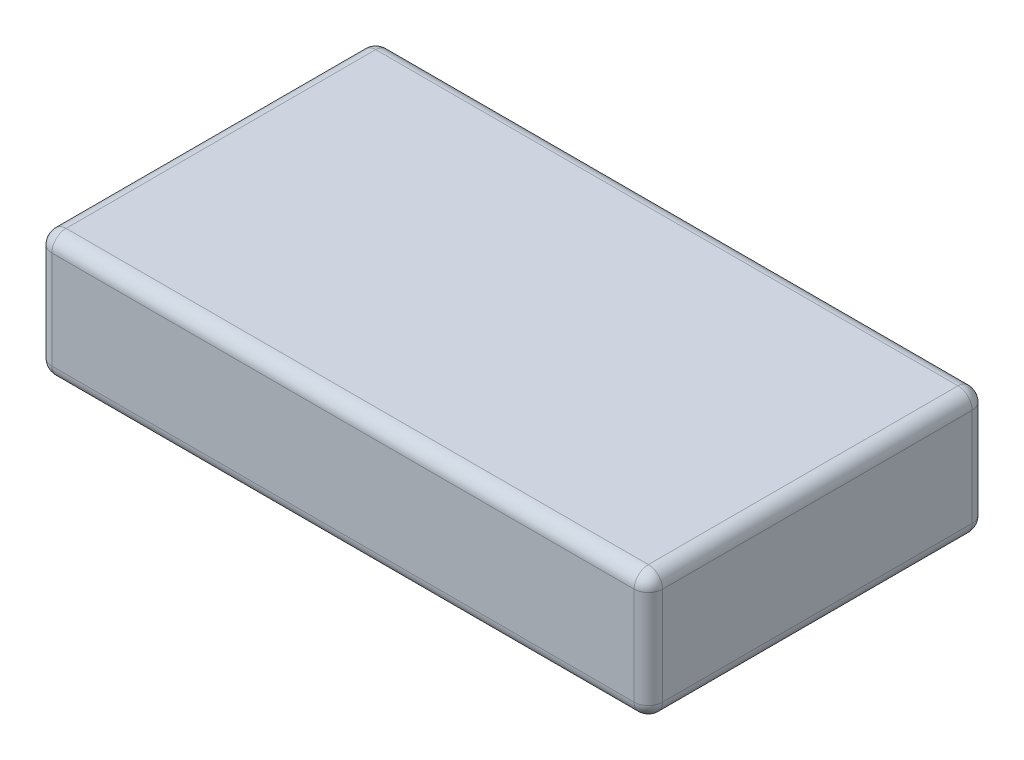
ISO-10303-21;
HEADER;
FILE_DESCRIPTION(('STEP AP214'),'2;1');
FILE_NAME('part.step','',(''),(''),'','','');
FILE_SCHEMA(('AUTOMOTIVE_DESIGN { 1 0 10303 214 1 1 1 1 }'));
ENDSEC;
DATA;
#1=APPLICATION_CONTEXT('core data for automotive mechanical design processes');
#2=APPLICATION_PROTOCOL_DEFINITION('international standard','automotive_design',2000,#1);
#3=PRODUCT_CONTEXT('',#1,'mechanical');
#4=PRODUCT('Part','Part','',(#3));
#5=PRODUCT_RELATED_PRODUCT_CATEGORY('part','',(#4));
#6=PRODUCT_DEFINITION_FORMATION('','',#4);
#7=PRODUCT_DEFINITION_CONTEXT('part definition',#1,'design');
#8=PRODUCT_DEFINITION('design','',#6,#7);
#9=PRODUCT_DEFINITION_SHAPE('','',#8);
#10=(LENGTH_UNIT() NAMED_UNIT(*) SI_UNIT(.MILLI.,.METRE.));
#11=(NAMED_UNIT(*) PLANE_ANGLE_UNIT() SI_UNIT($,.RADIAN.));
#12=(NAMED_UNIT(*) SI_UNIT($,.STERADIAN.) SOLID_ANGLE_UNIT());
#13=UNCERTAINTY_MEASURE_WITH_UNIT(LENGTH_MEASURE(1.E-05),#10,'distance_accuracy_value','');
#14=(GEOMETRIC_REPRESENTATION_CONTEXT(3) GLOBAL_UNCERTAINTY_ASSIGNED_CONTEXT((#13)) GLOBAL_UNIT_ASSIGNED_CONTEXT((#10,
#11,#12)) REPRESENTATION_CONTEXT('',''));
#15=CARTESIAN_POINT('',(0.,0.,0.));
#16=DIRECTION('',(0.,0.,1.));
#17=DIRECTION('',(1.,0.,0.));
#18=AXIS2_PLACEMENT_3D('',#15,#16,#17);
#19=CARTESIAN_POINT('',(-20.5,8.89,10.9));
#20=DIRECTION('',(0.,-1.,0.));
#21=DIRECTION('',(0.,0.,-1.));
#22=AXIS2_PLACEMENT_3D('',#19,#20,#21);
#23=CYLINDRICAL_SURFACE('',#22,1.);
#24=DIRECTION('',(0.,-1.,0.));
#25=VECTOR('',#24,1.);
#26=CARTESIAN_POINT('',(-21.5,8.89,10.9));
#27=LINE('',#26,#25);
#28=CARTESIAN_POINT('',(-21.5,7.89,10.9));
#29=VERTEX_POINT('',#28);
#30=CARTESIAN_POINT('',(-21.5,1.,10.9));
#31=VERTEX_POINT('',#30);
#32=EDGE_CURVE('E225',#29,#31,#27,.T.);
#33=ORIENTED_EDGE('',*,*,#32,.T.);
#34=CARTESIAN_POINT('',(-20.5,1.,10.9));
#35=DIRECTION('',(0.,-1.,0.));
#36=DIRECTION('',(0.,0.,-1.));
#37=AXIS2_PLACEMENT_3D('',#34,#35,#36);
#38=CIRCLE('',#37,1.);
#39=CARTESIAN_POINT('',(-20.5,1.,11.9));
#40=VERTEX_POINT('',#39);
#41=EDGE_CURVE('E197',#31,#40,#38,.F.);
#42=ORIENTED_EDGE('',*,*,#41,.T.);
#43=DIRECTION('',(0.,-1.,0.));
#44=VECTOR('',#43,1.);
#45=CARTESIAN_POINT('',(-20.5,8.89,11.9));
#46=LINE('',#45,#44);
#47=CARTESIAN_POINT('',(-20.5,7.89,11.9));
#48=VERTEX_POINT('',#47);
#49=EDGE_CURVE('E145',#48,#40,#46,.T.);
#50=ORIENTED_EDGE('',*,*,#49,.F.);
#51=CARTESIAN_POINT('',(-20.5,7.89,10.9));
#52=DIRECTION('',(0.,-1.,0.));
#53=DIRECTION('',(0.,0.,-1.));
#54=AXIS2_PLACEMENT_3D('',#51,#52,#53);
#55=CIRCLE('',#54,1.);
#56=EDGE_CURVE('E195',#48,#29,#55,.T.);
#57=ORIENTED_EDGE('',*,*,#56,.T.);
#58=EDGE_LOOP('',(#33,#42,#50,#57));
#59=FACE_BOUND('',#58,.T.);
#60=ADVANCED_FACE('F33',(#59),#23,.T.);
#61=CARTESIAN_POINT('',(-20.5,8.89,11.9));
#62=DIRECTION('',(0.,0.,-1.));
#63=DIRECTION('',(-1.,0.,0.));
#64=AXIS2_PLACEMENT_3D('',#61,#62,#63);
#65=PLANE('',#64);
#66=ORIENTED_EDGE('',*,*,#49,.T.);
#67=DIRECTION('',(1.,0.,0.));
#68=VECTOR('',#67,1.);
#69=CARTESIAN_POINT('',(20.5,0.999999999999999,11.9));
#70=LINE('',#69,#68);
#71=CARTESIAN_POINT('',(20.5,1.,11.9));
#72=VERTEX_POINT('',#71);
#73=EDGE_CURVE('E144',#40,#72,#70,.T.);
#74=ORIENTED_EDGE('',*,*,#73,.T.);
#75=DIRECTION('',(0.,-1.,0.));
#76=VECTOR('',#75,1.);
#77=CARTESIAN_POINT('',(20.5,8.89,11.9));
#78=LINE('',#77,#76);
#79=CARTESIAN_POINT('',(20.5,7.89,11.9));
#80=VERTEX_POINT('',#79);
#81=EDGE_CURVE('E126',#80,#72,#78,.T.);
#82=ORIENTED_EDGE('',*,*,#81,.F.);
#83=DIRECTION('',(1.,0.,0.));
#84=VECTOR('',#83,1.);
#85=CARTESIAN_POINT('',(-20.5,7.89,11.9));
#86=LINE('',#85,#84);
#87=EDGE_CURVE('E141',#80,#48,#86,.F.);
#88=ORIENTED_EDGE('',*,*,#87,.T.);
#89=EDGE_LOOP('',(#66,#74,#82,#88));
#90=FACE_BOUND('',#89,.T.);
#91=ADVANCED_FACE('F139',(#90),#65,.F.);
#92=CARTESIAN_POINT('',(20.5,8.89,10.9));
#93=DIRECTION('',(0.,-1.,0.));
#94=DIRECTION('',(0.,0.,-1.));
#95=AXIS2_PLACEMENT_3D('',#92,#93,#94);
#96=CYLINDRICAL_SURFACE('',#95,1.);
#97=ORIENTED_EDGE('',*,*,#81,.T.);
#98=CARTESIAN_POINT('',(20.5,1.,10.9));
#99=DIRECTION('',(0.,-1.,0.));
#100=DIRECTION('',(0.,0.,-1.));
#101=AXIS2_PLACEMENT_3D('',#98,#99,#100);
#102=CIRCLE('',#101,1.);
#103=CARTESIAN_POINT('',(21.5,1.,10.9));
#104=VERTEX_POINT('',#103);
#105=EDGE_CURVE('E133',#72,#104,#102,.F.);
#106=ORIENTED_EDGE('',*,*,#105,.T.);
#107=DIRECTION('',(0.,-1.,0.));
#108=VECTOR('',#107,1.);
#109=CARTESIAN_POINT('',(21.5,8.89,10.9));
#110=LINE('',#109,#108);
#111=CARTESIAN_POINT('',(21.5,7.89,10.9));
#112=VERTEX_POINT('',#111);
#113=EDGE_CURVE('E128',#112,#104,#110,.T.);
#114=ORIENTED_EDGE('',*,*,#113,.F.);
#115=CARTESIAN_POINT('',(20.5,7.89,10.9));
#116=DIRECTION('',(0.,-1.,0.));
#117=DIRECTION('',(0.,0.,-1.));
#118=AXIS2_PLACEMENT_3D('',#115,#116,#117);
#119=CIRCLE('',#118,1.);
#120=EDGE_CURVE('E123',#112,#80,#119,.T.);
#121=ORIENTED_EDGE('',*,*,#120,.T.);
#122=EDGE_LOOP('',(#97,#106,#114,#121));
#123=FACE_BOUND('',#122,.T.);
#124=ADVANCED_FACE('F125',(#123),#96,.T.);
#125=CARTESIAN_POINT('',(21.5,8.89,10.9));
#126=DIRECTION('',(-1.,0.,0.));
#127=DIRECTION('',(0.,0.,1.));
#128=AXIS2_PLACEMENT_3D('',#125,#126,#127);
#129=PLANE('',#128);
#130=ORIENTED_EDGE('',*,*,#113,.T.);
#131=DIRECTION('',(0.,0.,-1.));
#132=VECTOR('',#131,1.);
#133=CARTESIAN_POINT('',(21.5,0.999999999999999,-10.9));
#134=LINE('',#133,#132);
#135=CARTESIAN_POINT('',(21.5,1.,-10.9));
#136=VERTEX_POINT('',#135);
#137=EDGE_CURVE('E176',#104,#136,#134,.T.);
#138=ORIENTED_EDGE('',*,*,#137,.T.);
#139=DIRECTION('',(0.,-1.,0.));
#140=VECTOR('',#139,1.);
#141=CARTESIAN_POINT('',(21.5,8.89,-10.9));
#142=LINE('',#141,#140);
#143=CARTESIAN_POINT('',(21.5,7.89,-10.9));
#144=VERTEX_POINT('',#143);
#145=EDGE_CURVE('E246',#144,#136,#142,.T.);
#146=ORIENTED_EDGE('',*,*,#145,.F.);
#147=DIRECTION('',(0.,0.,-1.));
#148=VECTOR('',#147,1.);
#149=CARTESIAN_POINT('',(21.5,7.89,10.9));
#150=LINE('',#149,#148);
#151=EDGE_CURVE('E174',#144,#112,#150,.F.);
#152=ORIENTED_EDGE('',*,*,#151,.T.);
#153=EDGE_LOOP('',(#130,#138,#146,#152));
#154=FACE_BOUND('',#153,.T.);
#155=ADVANCED_FACE('F243',(#154),#129,.F.);
#156=CARTESIAN_POINT('',(20.5,8.89,-10.9));
#157=DIRECTION('',(0.,-1.,0.));
#158=DIRECTION('',(0.,0.,-1.));
#159=AXIS2_PLACEMENT_3D('',#156,#157,#158);
#160=CYLINDRICAL_SURFACE('',#159,1.);
#161=ORIENTED_EDGE('',*,*,#145,.T.);
#162=CARTESIAN_POINT('',(20.5,1.,-10.9));
#163=DIRECTION('',(0.,-1.,0.));
#164=DIRECTION('',(0.,0.,-1.));
#165=AXIS2_PLACEMENT_3D('',#162,#163,#164);
#166=CIRCLE('',#165,1.);
#167=CARTESIAN_POINT('',(20.5,1.,-11.9));
#168=VERTEX_POINT('',#167);
#169=EDGE_CURVE('E180',#136,#168,#166,.F.);
#170=ORIENTED_EDGE('',*,*,#169,.T.);
#171=DIRECTION('',(0.,-1.,0.));
#172=VECTOR('',#171,1.);
#173=CARTESIAN_POINT('',(20.5,8.89,-11.9));
#174=LINE('',#173,#172);
#175=CARTESIAN_POINT('',(20.5,7.89,-11.9));
#176=VERTEX_POINT('',#175);
#177=EDGE_CURVE('E249',#176,#168,#174,.T.);
#178=ORIENTED_EDGE('',*,*,#177,.F.);
#179=CARTESIAN_POINT('',(20.5,7.89,-10.9));
#180=DIRECTION('',(0.,-1.,0.));
#181=DIRECTION('',(0.,0.,-1.));
#182=AXIS2_PLACEMENT_3D('',#179,#180,#181);
#183=CIRCLE('',#182,1.);
#184=EDGE_CURVE('E178',#176,#144,#183,.T.);
#185=ORIENTED_EDGE('',*,*,#184,.T.);
#186=EDGE_LOOP('',(#161,#170,#178,#185));
#187=FACE_BOUND('',#186,.T.);
#188=ADVANCED_FACE('F291',(#187),#160,.T.);
#189=CARTESIAN_POINT('',(-20.5,8.89,-11.9));
#190=DIRECTION('',(0.,0.,1.));
#191=DIRECTION('',(1.,0.,0.));
#192=AXIS2_PLACEMENT_3D('',#189,#190,#191);
#193=PLANE('',#192);
#194=ORIENTED_EDGE('',*,*,#177,.T.);
#195=DIRECTION('',(-1.,0.,0.));
#196=VECTOR('',#195,1.);
#197=CARTESIAN_POINT('',(-20.5,0.999999999999999,-11.9));
#198=LINE('',#197,#196);
#199=CARTESIAN_POINT('',(-20.5,1.,-11.9));
#200=VERTEX_POINT('',#199);
#201=EDGE_CURVE('E184',#168,#200,#198,.T.);
#202=ORIENTED_EDGE('',*,*,#201,.T.);
#203=DIRECTION('',(0.,-1.,0.));
#204=VECTOR('',#203,1.);
#205=CARTESIAN_POINT('',(-20.5,8.89,-11.9));
#206=LINE('',#205,#204);
#207=CARTESIAN_POINT('',(-20.5,7.89,-11.9));
#208=VERTEX_POINT('',#207);
#209=EDGE_CURVE('E253',#208,#200,#206,.T.);
#210=ORIENTED_EDGE('',*,*,#209,.F.);
#211=DIRECTION('',(-1.,0.,0.));
#212=VECTOR('',#211,1.);
#213=CARTESIAN_POINT('',(-20.5,7.89,-11.9));
#214=LINE('',#213,#212);
#215=EDGE_CURVE('E182',#208,#176,#214,.F.);
#216=ORIENTED_EDGE('',*,*,#215,.T.);
#217=EDGE_LOOP('',(#194,#202,#210,#216));
#218=FACE_BOUND('',#217,.T.);
#219=ADVANCED_FACE('F294',(#218),#193,.F.);
#220=CARTESIAN_POINT('',(-20.5,8.89,-10.9));
#221=DIRECTION('',(0.,-1.,0.));
#222=DIRECTION('',(0.,0.,-1.));
#223=AXIS2_PLACEMENT_3D('',#220,#221,#222);
#224=CYLINDRICAL_SURFACE('',#223,1.);
#225=ORIENTED_EDGE('',*,*,#209,.T.);
#226=CARTESIAN_POINT('',(-20.5,1.,-10.9));
#227=DIRECTION('',(0.,-1.,0.));
#228=DIRECTION('',(0.,0.,-1.));
#229=AXIS2_PLACEMENT_3D('',#226,#227,#228);
#230=CIRCLE('',#229,1.);
#231=CARTESIAN_POINT('',(-21.5,1.,-10.9));
#232=VERTEX_POINT('',#231);
#233=EDGE_CURVE('E188',#200,#232,#230,.F.);
#234=ORIENTED_EDGE('',*,*,#233,.T.);
#235=DIRECTION('',(0.,-1.,0.));
#236=VECTOR('',#235,1.);
#237=CARTESIAN_POINT('',(-21.5,8.89,-10.9));
#238=LINE('',#237,#236);
#239=CARTESIAN_POINT('',(-21.5,7.89,-10.9));
#240=VERTEX_POINT('',#239);
#241=EDGE_CURVE('E258',#240,#232,#238,.T.);
#242=ORIENTED_EDGE('',*,*,#241,.F.);
#243=CARTESIAN_POINT('',(-20.5,7.89,-10.9));
#244=DIRECTION('',(0.,-1.,0.));
#245=DIRECTION('',(0.,0.,-1.));
#246=AXIS2_PLACEMENT_3D('',#243,#244,#245);
#247=CIRCLE('',#246,1.);
#248=EDGE_CURVE('E186',#240,#208,#247,.T.);
#249=ORIENTED_EDGE('',*,*,#248,.T.);
#250=EDGE_LOOP('',(#225,#234,#242,#249));
#251=FACE_BOUND('',#250,.T.);
#252=ADVANCED_FACE('F307',(#251),#224,.T.);
#253=CARTESIAN_POINT('',(-21.5,8.89,10.9));
#254=DIRECTION('',(1.,0.,0.));
#255=DIRECTION('',(0.,0.,-1.));
#256=AXIS2_PLACEMENT_3D('',#253,#254,#255);
#257=PLANE('',#256);
#258=ORIENTED_EDGE('',*,*,#241,.T.);
#259=DIRECTION('',(0.,0.,1.));
#260=VECTOR('',#259,1.);
#261=CARTESIAN_POINT('',(-21.5,0.999999999999999,10.9));
#262=LINE('',#261,#260);
#263=EDGE_CURVE('E193',#232,#31,#262,.T.);
#264=ORIENTED_EDGE('',*,*,#263,.T.);
#265=ORIENTED_EDGE('',*,*,#32,.F.);
#266=DIRECTION('',(0.,0.,1.));
#267=VECTOR('',#266,1.);
#268=CARTESIAN_POINT('',(-21.5,7.89,10.9));
#269=LINE('',#268,#267);
#270=EDGE_CURVE('E190',#29,#240,#269,.F.);
#271=ORIENTED_EDGE('',*,*,#270,.T.);
#272=EDGE_LOOP('',(#258,#264,#265,#271));
#273=FACE_BOUND('',#272,.T.);
#274=ADVANCED_FACE('F308',(#273),#257,.F.);
#275=CARTESIAN_POINT('',(-20.5,8.89,10.9));
#276=DIRECTION('',(0.,-1.,0.));
#277=DIRECTION('',(0.,0.,-1.));
#278=AXIS2_PLACEMENT_3D('',#275,#276,#277);
#279=PLANE('',#278);
#280=DIRECTION('',(-1.,0.,0.));
#281=VECTOR('',#280,1.);
#282=CARTESIAN_POINT('',(-20.5,8.89,-10.9));
#283=LINE('',#282,#281);
#284=CARTESIAN_POINT('',(20.5,8.89,-10.9));
#285=VERTEX_POINT('',#284);
#286=CARTESIAN_POINT('',(-20.5,8.89,-10.9));
#287=VERTEX_POINT('',#286);
#288=EDGE_CURVE('E42',#285,#287,#283,.T.);
#289=ORIENTED_EDGE('',*,*,#288,.T.);
#290=DIRECTION('',(0.,0.,1.));
#291=VECTOR('',#290,1.);
#292=CARTESIAN_POINT('',(-20.5,8.89,10.9));
#293=LINE('',#292,#291);
#294=CARTESIAN_POINT('',(-20.5,8.89,10.9));
#295=VERTEX_POINT('',#294);
#296=EDGE_CURVE('E11',#287,#295,#293,.T.);
#297=ORIENTED_EDGE('',*,*,#296,.T.);
#298=DIRECTION('',(1.,0.,0.));
#299=VECTOR('',#298,1.);
#300=CARTESIAN_POINT('',(-20.5,8.89,10.9));
#301=LINE('',#300,#299);
#302=CARTESIAN_POINT('',(20.5,8.89,10.9));
#303=VERTEX_POINT('',#302);
#304=EDGE_CURVE('E199',#295,#303,#301,.T.);
#305=ORIENTED_EDGE('',*,*,#304,.T.);
#306=DIRECTION('',(0.,0.,-1.));
#307=VECTOR('',#306,1.);
#308=CARTESIAN_POINT('',(20.5,8.89,10.9));
#309=LINE('',#308,#307);
#310=EDGE_CURVE('E53',#303,#285,#309,.T.);
#311=ORIENTED_EDGE('',*,*,#310,.T.);
#312=EDGE_LOOP('',(#289,#297,#305,#311));
#313=FACE_BOUND('',#312,.T.);
#314=ADVANCED_FACE('F317',(#313),#279,.F.);
#315=CARTESIAN_POINT('',(-20.5,0.,10.9));
#316=DIRECTION('',(0.,-1.,0.));
#317=DIRECTION('',(0.,0.,-1.));
#318=AXIS2_PLACEMENT_3D('',#315,#316,#317);
#319=PLANE('',#318);
#320=DIRECTION('',(0.,0.,-1.));
#321=VECTOR('',#320,1.);
#322=CARTESIAN_POINT('',(20.5,0.,10.9));
#323=LINE('',#322,#321);
#324=CARTESIAN_POINT('',(20.5,0.,-10.9));
#325=VERTEX_POINT('',#324);
#326=CARTESIAN_POINT('',(20.5,0.,10.9));
#327=VERTEX_POINT('',#326);
#328=EDGE_CURVE('E169',#325,#327,#323,.F.);
#329=ORIENTED_EDGE('',*,*,#328,.T.);
#330=DIRECTION('',(1.,0.,0.));
#331=VECTOR('',#330,1.);
#332=CARTESIAN_POINT('',(-20.5,0.,10.9));
#333=LINE('',#332,#331);
#334=CARTESIAN_POINT('',(-20.5,0.,10.9));
#335=VERTEX_POINT('',#334);
#336=EDGE_CURVE('E134',#327,#335,#333,.F.);
#337=ORIENTED_EDGE('',*,*,#336,.T.);
#338=DIRECTION('',(0.,0.,1.));
#339=VECTOR('',#338,1.);
#340=CARTESIAN_POINT('',(-20.5,0.,-10.9));
#341=LINE('',#340,#339);
#342=CARTESIAN_POINT('',(-20.5,0.,-10.9));
#343=VERTEX_POINT('',#342);
#344=EDGE_CURVE('E162',#335,#343,#341,.F.);
#345=ORIENTED_EDGE('',*,*,#344,.T.);
#346=DIRECTION('',(-1.,0.,0.));
#347=VECTOR('',#346,1.);
#348=CARTESIAN_POINT('',(20.5,0.,-10.9));
#349=LINE('',#348,#347);
#350=EDGE_CURVE('E167',#343,#325,#349,.F.);
#351=ORIENTED_EDGE('',*,*,#350,.T.);
#352=EDGE_LOOP('',(#329,#337,#345,#351));
#353=FACE_BOUND('',#352,.T.);
#354=ADVANCED_FACE('F319',(#353),#319,.T.);
#355=CARTESIAN_POINT('',(-20.5,0.999999999999999,-10.9));
#356=DIRECTION('',(1.,0.,0.));
#357=DIRECTION('',(0.,0.,-1.));
#358=AXIS2_PLACEMENT_3D('',#355,#356,#357);
#359=CYLINDRICAL_SURFACE('',#358,1.);
#360=CARTESIAN_POINT('',(-20.5,0.999999999999999,-10.9));
#361=DIRECTION('',(-1.,0.,0.));
#362=DIRECTION('',(0.,0.,1.));
#363=AXIS2_PLACEMENT_3D('',#360,#361,#362);
#364=CIRCLE('',#363,1.);
#365=EDGE_CURVE('E222',#200,#343,#364,.T.);
#366=ORIENTED_EDGE('',*,*,#365,.F.);
#367=ORIENTED_EDGE('',*,*,#201,.F.);
#368=CARTESIAN_POINT('',(20.5,1.,-10.9));
#369=DIRECTION('',(1.,0.,0.));
#370=DIRECTION('',(0.,0.,-1.));
#371=AXIS2_PLACEMENT_3D('',#368,#369,#370);
#372=CIRCLE('',#371,1.);
#373=EDGE_CURVE('E219',#325,#168,#372,.T.);
#374=ORIENTED_EDGE('',*,*,#373,.F.);
#375=ORIENTED_EDGE('',*,*,#350,.F.);
#376=EDGE_LOOP('',(#366,#367,#374,#375));
#377=FACE_BOUND('',#376,.T.);
#378=ADVANCED_FACE('F299',(#377),#359,.T.);
#379=CARTESIAN_POINT('',(-20.5,0.999999999999999,-10.9));
#380=DIRECTION('',(0.,-1.,0.));
#381=DIRECTION('',(0.,0.,-1.));
#382=AXIS2_PLACEMENT_3D('',#379,#380,#381);
#383=SPHERICAL_SURFACE('',#382,1.);
#384=ORIENTED_EDGE('',*,*,#233,.F.);
#385=ORIENTED_EDGE('',*,*,#365,.T.);
#386=CARTESIAN_POINT('',(-20.5,1.,-10.9));
#387=DIRECTION('',(0.,0.,1.));
#388=DIRECTION('',(1.,0.,0.));
#389=AXIS2_PLACEMENT_3D('',#386,#387,#388);
#390=CIRCLE('',#389,1.);
#391=EDGE_CURVE('E216',#232,#343,#390,.T.);
#392=ORIENTED_EDGE('',*,*,#391,.F.);
#393=EDGE_LOOP('',(#384,#385,#392));
#394=FACE_BOUND('',#393,.T.);
#395=ADVANCED_FACE('F304',(#394),#383,.T.);
#396=CARTESIAN_POINT('',(20.5,0.999999999999999,-10.9));
#397=DIRECTION('',(0.,-1.,0.));
#398=DIRECTION('',(0.,0.,-1.));
#399=AXIS2_PLACEMENT_3D('',#396,#397,#398);
#400=SPHERICAL_SURFACE('',#399,1.);
#401=ORIENTED_EDGE('',*,*,#373,.T.);
#402=ORIENTED_EDGE('',*,*,#169,.F.);
#403=CARTESIAN_POINT('',(20.5,1.,-10.9));
#404=DIRECTION('',(0.,0.,1.));
#405=DIRECTION('',(1.,0.,0.));
#406=AXIS2_PLACEMENT_3D('',#403,#404,#405);
#407=CIRCLE('',#406,1.);
#408=EDGE_CURVE('E213',#325,#136,#407,.T.);
#409=ORIENTED_EDGE('',*,*,#408,.F.);
#410=EDGE_LOOP('',(#401,#402,#409));
#411=FACE_BOUND('',#410,.T.);
#412=ADVANCED_FACE('F288',(#411),#400,.T.);
#413=CARTESIAN_POINT('',(-20.5,0.999999999999999,10.9));
#414=DIRECTION('',(0.,0.,-1.));
#415=DIRECTION('',(-1.,0.,0.));
#416=AXIS2_PLACEMENT_3D('',#413,#414,#415);
#417=CYLINDRICAL_SURFACE('',#416,1.);
#418=ORIENTED_EDGE('',*,*,#391,.T.);
#419=ORIENTED_EDGE('',*,*,#344,.F.);
#420=CARTESIAN_POINT('',(-20.5,0.999999999999999,10.9));
#421=DIRECTION('',(0.,0.,1.));
#422=DIRECTION('',(1.,0.,0.));
#423=AXIS2_PLACEMENT_3D('',#420,#421,#422);
#424=CIRCLE('',#423,1.);
#425=EDGE_CURVE('E210',#31,#335,#424,.T.);
#426=ORIENTED_EDGE('',*,*,#425,.F.);
#427=ORIENTED_EDGE('',*,*,#263,.F.);
#428=EDGE_LOOP('',(#418,#419,#426,#427));
#429=FACE_BOUND('',#428,.T.);
#430=ADVANCED_FACE('F271',(#429),#417,.T.);
#431=CARTESIAN_POINT('',(20.5,0.999999999999999,10.9));
#432=DIRECTION('',(0.,0.,1.));
#433=DIRECTION('',(1.,0.,0.));
#434=AXIS2_PLACEMENT_3D('',#431,#432,#433);
#435=CYLINDRICAL_SURFACE('',#434,1.);
#436=ORIENTED_EDGE('',*,*,#408,.T.);
#437=ORIENTED_EDGE('',*,*,#137,.F.);
#438=CARTESIAN_POINT('',(20.5,1.,10.9));
#439=DIRECTION('',(0.,0.,1.));
#440=DIRECTION('',(1.,0.,0.));
#441=AXIS2_PLACEMENT_3D('',#438,#439,#440);
#442=CIRCLE('',#441,1.);
#443=EDGE_CURVE('E207',#327,#104,#442,.T.);
#444=ORIENTED_EDGE('',*,*,#443,.F.);
#445=ORIENTED_EDGE('',*,*,#328,.F.);
#446=EDGE_LOOP('',(#436,#437,#444,#445));
#447=FACE_BOUND('',#446,.T.);
#448=ADVANCED_FACE('F285',(#447),#435,.T.);
#449=CARTESIAN_POINT('',(-20.5,0.999999999999999,10.9));
#450=DIRECTION('',(0.,-1.,0.));
#451=DIRECTION('',(0.,0.,-1.));
#452=AXIS2_PLACEMENT_3D('',#449,#450,#451);
#453=SPHERICAL_SURFACE('',#452,1.);
#454=ORIENTED_EDGE('',*,*,#41,.F.);
#455=ORIENTED_EDGE('',*,*,#425,.T.);
#456=CARTESIAN_POINT('',(-20.5,1.,10.9));
#457=DIRECTION('',(1.,0.,0.));
#458=DIRECTION('',(0.,0.,-1.));
#459=AXIS2_PLACEMENT_3D('',#456,#457,#458);
#460=CIRCLE('',#459,1.);
#461=EDGE_CURVE('E205',#40,#335,#460,.T.);
#462=ORIENTED_EDGE('',*,*,#461,.F.);
#463=EDGE_LOOP('',(#454,#455,#462));
#464=FACE_BOUND('',#463,.T.);
#465=ADVANCED_FACE('F274',(#464),#453,.T.);
#466=CARTESIAN_POINT('',(20.5,0.999999999999999,10.9));
#467=DIRECTION('',(0.,-1.,0.));
#468=DIRECTION('',(0.,0.,-1.));
#469=AXIS2_PLACEMENT_3D('',#466,#467,#468);
#470=SPHERICAL_SURFACE('',#469,1.);
#471=ORIENTED_EDGE('',*,*,#443,.T.);
#472=ORIENTED_EDGE('',*,*,#105,.F.);
#473=CARTESIAN_POINT('',(20.5,1.,10.9));
#474=DIRECTION('',(-1.,0.,0.));
#475=DIRECTION('',(0.,0.,1.));
#476=AXIS2_PLACEMENT_3D('',#473,#474,#475);
#477=CIRCLE('',#476,1.);
#478=EDGE_CURVE('E203',#327,#72,#477,.T.);
#479=ORIENTED_EDGE('',*,*,#478,.F.);
#480=EDGE_LOOP('',(#471,#472,#479));
#481=FACE_BOUND('',#480,.T.);
#482=ADVANCED_FACE('F281',(#481),#470,.T.);
#483=CARTESIAN_POINT('',(-20.5,0.999999999999999,10.9));
#484=DIRECTION('',(-1.,0.,0.));
#485=DIRECTION('',(0.,0.,1.));
#486=AXIS2_PLACEMENT_3D('',#483,#484,#485);
#487=CYLINDRICAL_SURFACE('',#486,1.);
#488=ORIENTED_EDGE('',*,*,#461,.T.);
#489=ORIENTED_EDGE('',*,*,#336,.F.);
#490=ORIENTED_EDGE('',*,*,#478,.T.);
#491=ORIENTED_EDGE('',*,*,#73,.F.);
#492=EDGE_LOOP('',(#488,#489,#490,#491));
#493=FACE_BOUND('',#492,.T.);
#494=ADVANCED_FACE('F277',(#493),#487,.T.);
#495=CARTESIAN_POINT('',(20.5,7.89,10.9));
#496=DIRECTION('',(0.,0.,-1.));
#497=DIRECTION('',(-1.,0.,0.));
#498=AXIS2_PLACEMENT_3D('',#495,#496,#497);
#499=CYLINDRICAL_SURFACE('',#498,1.);
#500=CARTESIAN_POINT('',(20.5,7.89,10.9));
#501=DIRECTION('',(0.,0.,1.));
#502=DIRECTION('',(1.,0.,0.));
#503=AXIS2_PLACEMENT_3D('',#500,#501,#502);
#504=CIRCLE('',#503,1.);
#505=EDGE_CURVE('E150',#112,#303,#504,.T.);
#506=ORIENTED_EDGE('',*,*,#505,.F.);
#507=ORIENTED_EDGE('',*,*,#151,.F.);
#508=CARTESIAN_POINT('',(20.5,7.89,-10.9));
#509=DIRECTION('',(0.,0.,-1.));
#510=DIRECTION('',(-1.,0.,0.));
#511=AXIS2_PLACEMENT_3D('',#508,#509,#510);
#512=CIRCLE('',#511,1.);
#513=EDGE_CURVE('E37',#285,#144,#512,.T.);
#514=ORIENTED_EDGE('',*,*,#513,.F.);
#515=ORIENTED_EDGE('',*,*,#310,.F.);
#516=EDGE_LOOP('',(#506,#507,#514,#515));
#517=FACE_BOUND('',#516,.T.);
#518=ADVANCED_FACE('F35',(#517),#499,.T.);
#519=CARTESIAN_POINT('',(20.5,7.89,-10.9));
#520=DIRECTION('',(0.,-1.,0.));
#521=DIRECTION('',(0.,0.,-1.));
#522=AXIS2_PLACEMENT_3D('',#519,#520,#521);
#523=SPHERICAL_SURFACE('',#522,1.);
#524=ORIENTED_EDGE('',*,*,#513,.T.);
#525=ORIENTED_EDGE('',*,*,#184,.F.);
#526=CARTESIAN_POINT('',(20.5,7.89,-10.9));
#527=DIRECTION('',(-1.,0.,0.));
#528=DIRECTION('',(0.,0.,1.));
#529=AXIS2_PLACEMENT_3D('',#526,#527,#528);
#530=CIRCLE('',#529,1.);
#531=EDGE_CURVE('E153',#285,#176,#530,.T.);
#532=ORIENTED_EDGE('',*,*,#531,.F.);
#533=EDGE_LOOP('',(#524,#525,#532));
#534=FACE_BOUND('',#533,.T.);
#535=ADVANCED_FACE('F238',(#534),#523,.T.);
#536=CARTESIAN_POINT('',(20.5,7.89,10.9));
#537=DIRECTION('',(0.,-1.,0.));
#538=DIRECTION('',(0.,0.,-1.));
#539=AXIS2_PLACEMENT_3D('',#536,#537,#538);
#540=SPHERICAL_SURFACE('',#539,1.);
#541=ORIENTED_EDGE('',*,*,#120,.F.);
#542=ORIENTED_EDGE('',*,*,#505,.T.);
#543=CARTESIAN_POINT('',(20.5,7.89,10.9));
#544=DIRECTION('',(-1.,0.,0.));
#545=DIRECTION('',(0.,0.,1.));
#546=AXIS2_PLACEMENT_3D('',#543,#544,#545);
#547=CIRCLE('',#546,1.);
#548=EDGE_CURVE('E148',#80,#303,#547,.T.);
#549=ORIENTED_EDGE('',*,*,#548,.F.);
#550=EDGE_LOOP('',(#541,#542,#549));
#551=FACE_BOUND('',#550,.T.);
#552=ADVANCED_FACE('F149',(#551),#540,.T.);
#553=CARTESIAN_POINT('',(-20.5,7.89,-10.9));
#554=DIRECTION('',(-1.,0.,0.));
#555=DIRECTION('',(0.,0.,1.));
#556=AXIS2_PLACEMENT_3D('',#553,#554,#555);
#557=CYLINDRICAL_SURFACE('',#556,1.);
#558=ORIENTED_EDGE('',*,*,#531,.T.);
#559=ORIENTED_EDGE('',*,*,#215,.F.);
#560=CARTESIAN_POINT('',(-20.5,7.89,-10.9));
#561=DIRECTION('',(-1.,0.,0.));
#562=DIRECTION('',(0.,0.,1.));
#563=AXIS2_PLACEMENT_3D('',#560,#561,#562);
#564=CIRCLE('',#563,1.);
#565=EDGE_CURVE('E154',#287,#208,#564,.T.);
#566=ORIENTED_EDGE('',*,*,#565,.F.);
#567=ORIENTED_EDGE('',*,*,#288,.F.);
#568=EDGE_LOOP('',(#558,#559,#566,#567));
#569=FACE_BOUND('',#568,.T.);
#570=ADVANCED_FACE('F362',(#569),#557,.T.);
#571=CARTESIAN_POINT('',(-20.5,7.89,10.9));
#572=DIRECTION('',(1.,0.,0.));
#573=DIRECTION('',(0.,0.,-1.));
#574=AXIS2_PLACEMENT_3D('',#571,#572,#573);
#575=CYLINDRICAL_SURFACE('',#574,1.);
#576=ORIENTED_EDGE('',*,*,#548,.T.);
#577=ORIENTED_EDGE('',*,*,#304,.F.);
#578=CARTESIAN_POINT('',(-20.5,7.89,10.9));
#579=DIRECTION('',(-1.,0.,0.));
#580=DIRECTION('',(0.,0.,1.));
#581=AXIS2_PLACEMENT_3D('',#578,#579,#580);
#582=CIRCLE('',#581,1.);
#583=EDGE_CURVE('E159',#48,#295,#582,.T.);
#584=ORIENTED_EDGE('',*,*,#583,.F.);
#585=ORIENTED_EDGE('',*,*,#87,.F.);
#586=EDGE_LOOP('',(#576,#577,#584,#585));
#587=FACE_BOUND('',#586,.T.);
#588=ADVANCED_FACE('F157',(#587),#575,.T.);
#589=CARTESIAN_POINT('',(-20.5,7.89,-10.9));
#590=DIRECTION('',(0.,-1.,0.));
#591=DIRECTION('',(0.,0.,-1.));
#592=AXIS2_PLACEMENT_3D('',#589,#590,#591);
#593=SPHERICAL_SURFACE('',#592,1.);
#594=ORIENTED_EDGE('',*,*,#565,.T.);
#595=ORIENTED_EDGE('',*,*,#248,.F.);
#596=CARTESIAN_POINT('',(-20.5,7.89,-10.9));
#597=DIRECTION('',(0.,0.,1.));
#598=DIRECTION('',(1.,0.,0.));
#599=AXIS2_PLACEMENT_3D('',#596,#597,#598);
#600=CIRCLE('',#599,1.);
#601=EDGE_CURVE('E228',#287,#240,#600,.T.);
#602=ORIENTED_EDGE('',*,*,#601,.F.);
#603=EDGE_LOOP('',(#594,#595,#602));
#604=FACE_BOUND('',#603,.T.);
#605=ADVANCED_FACE('F356',(#604),#593,.T.);
#606=CARTESIAN_POINT('',(-20.5,7.89,10.9));
#607=DIRECTION('',(0.,-1.,0.));
#608=DIRECTION('',(0.,0.,-1.));
#609=AXIS2_PLACEMENT_3D('',#606,#607,#608);
#610=SPHERICAL_SURFACE('',#609,1.);
#611=ORIENTED_EDGE('',*,*,#56,.F.);
#612=ORIENTED_EDGE('',*,*,#583,.T.);
#613=CARTESIAN_POINT('',(-20.5,7.89,10.9));
#614=DIRECTION('',(0.,0.,-1.));
#615=DIRECTION('',(-1.,0.,0.));
#616=AXIS2_PLACEMENT_3D('',#613,#614,#615);
#617=CIRCLE('',#616,1.);
#618=EDGE_CURVE('E226',#29,#295,#617,.T.);
#619=ORIENTED_EDGE('',*,*,#618,.F.);
#620=EDGE_LOOP('',(#611,#612,#619));
#621=FACE_BOUND('',#620,.T.);
#622=ADVANCED_FACE('F316',(#621),#610,.T.);
#623=CARTESIAN_POINT('',(-20.5,7.89,10.9));
#624=DIRECTION('',(0.,0.,1.));
#625=DIRECTION('',(1.,0.,0.));
#626=AXIS2_PLACEMENT_3D('',#623,#624,#625);
#627=CYLINDRICAL_SURFACE('',#626,1.);
#628=ORIENTED_EDGE('',*,*,#601,.T.);
#629=ORIENTED_EDGE('',*,*,#270,.F.);
#630=ORIENTED_EDGE('',*,*,#618,.T.);
#631=ORIENTED_EDGE('',*,*,#296,.F.);
#632=EDGE_LOOP('',(#628,#629,#630,#631));
#633=FACE_BOUND('',#632,.T.);
#634=ADVANCED_FACE('F311',(#633),#627,.T.);
#635=CLOSED_SHELL('',(#60,#91,#124,#155,#188,#219,#252,#274,#314,#354,#378,#395,#412,#430,#448,
#465,#482,#494,#518,#535,#552,#570,#588,#605,#622,#634));
#636=MANIFOLD_SOLID_BREP('B2',#635);
#637=ADVANCED_BREP_SHAPE_REPRESENTATION('',(#18,#636),#14);
#638=SHAPE_DEFINITION_REPRESENTATION(#9,#637);
ENDSEC;
END-ISO-10303-21;
